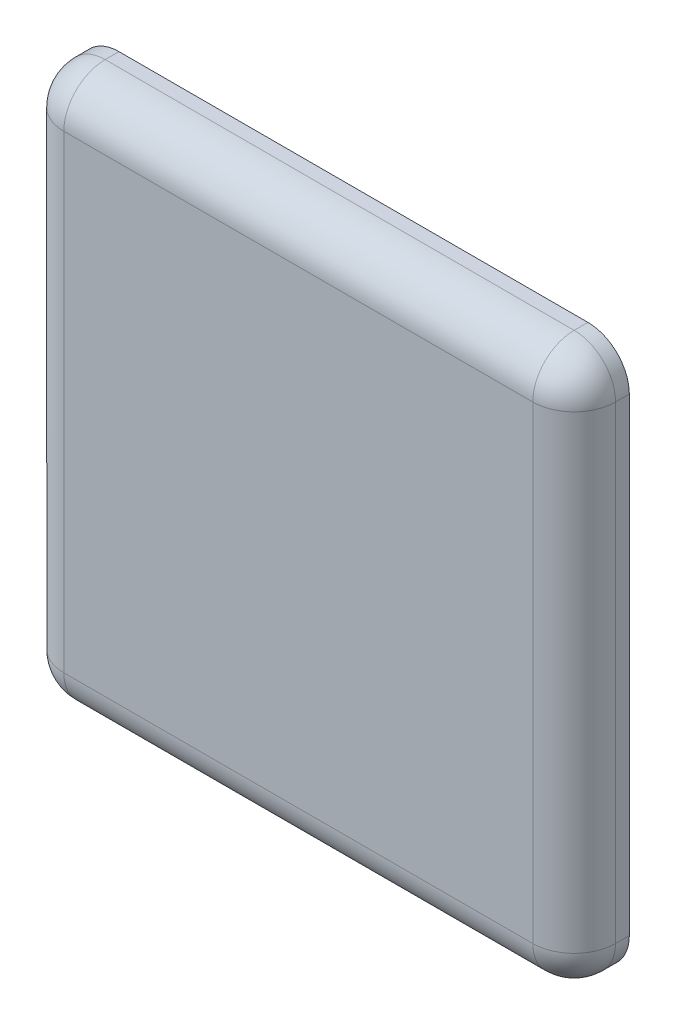
ISO-10303-21;
HEADER;
FILE_DESCRIPTION(('STEP AP214'),'2;1');
FILE_NAME('part.step','',(''),(''),'','','');
FILE_SCHEMA(('AUTOMOTIVE_DESIGN { 1 0 10303 214 1 1 1 1 }'));
ENDSEC;
DATA;
#1=APPLICATION_CONTEXT('core data for automotive mechanical design processes');
#2=APPLICATION_PROTOCOL_DEFINITION('international standard','automotive_design',2000,#1);
#3=PRODUCT_CONTEXT('',#1,'mechanical');
#4=PRODUCT('Part','Part','',(#3));
#5=PRODUCT_RELATED_PRODUCT_CATEGORY('part','',(#4));
#6=PRODUCT_DEFINITION_FORMATION('','',#4);
#7=PRODUCT_DEFINITION_CONTEXT('part definition',#1,'design');
#8=PRODUCT_DEFINITION('design','',#6,#7);
#9=PRODUCT_DEFINITION_SHAPE('','',#8);
#10=(LENGTH_UNIT() NAMED_UNIT(*) SI_UNIT(.MILLI.,.METRE.));
#11=(NAMED_UNIT(*) PLANE_ANGLE_UNIT() SI_UNIT($,.RADIAN.));
#12=(NAMED_UNIT(*) SI_UNIT($,.STERADIAN.) SOLID_ANGLE_UNIT());
#13=UNCERTAINTY_MEASURE_WITH_UNIT(LENGTH_MEASURE(1.E-05),#10,'distance_accuracy_value','');
#14=(GEOMETRIC_REPRESENTATION_CONTEXT(3) GLOBAL_UNCERTAINTY_ASSIGNED_CONTEXT((#13)) GLOBAL_UNIT_ASSIGNED_CONTEXT((#10,
#11,#12)) REPRESENTATION_CONTEXT('',''));
#15=CARTESIAN_POINT('',(0.,0.,0.));
#16=DIRECTION('',(0.,0.,1.));
#17=DIRECTION('',(1.,0.,0.));
#18=AXIS2_PLACEMENT_3D('',#15,#16,#17);
#19=CARTESIAN_POINT('',(0.,0.,3.));
#20=DIRECTION('',(0.,0.,1.));
#21=DIRECTION('',(1.,0.,0.));
#22=AXIS2_PLACEMENT_3D('',#19,#20,#21);
#23=PLANE('',#22);
#24=DIRECTION('',(-1.,0.,0.));
#25=VECTOR('',#24,1.);
#26=CARTESIAN_POINT('',(25.55241610428,12.75,3.));
#27=LINE('',#26,#25);
#28=CARTESIAN_POINT('',(-12.75,12.75,3.));
#29=VERTEX_POINT('',#28);
#30=CARTESIAN_POINT('',(12.75,12.75,3.));
#31=VERTEX_POINT('',#30);
#32=EDGE_CURVE('E104',#29,#31,#27,.F.);
#33=ORIENTED_EDGE('',*,*,#32,.F.);
#34=DIRECTION('',(0.,-1.,0.));
#35=VECTOR('',#34,1.);
#36=CARTESIAN_POINT('',(-12.75,25.55241610428,3.));
#37=LINE('',#36,#35);
#38=CARTESIAN_POINT('',(-12.75,-12.75,3.));
#39=VERTEX_POINT('',#38);
#40=EDGE_CURVE('E153',#39,#29,#37,.F.);
#41=ORIENTED_EDGE('',*,*,#40,.F.);
#42=DIRECTION('',(1.,0.,0.));
#43=VECTOR('',#42,1.);
#44=CARTESIAN_POINT('',(-25.55241610428,-12.75,3.));
#45=LINE('',#44,#43);
#46=CARTESIAN_POINT('',(12.75,-12.75,3.));
#47=VERTEX_POINT('',#46);
#48=EDGE_CURVE('E148',#47,#39,#45,.F.);
#49=ORIENTED_EDGE('',*,*,#48,.F.);
#50=DIRECTION('',(0.,1.,0.));
#51=VECTOR('',#50,1.);
#52=CARTESIAN_POINT('',(12.75,-25.55241610428,3.));
#53=LINE('',#52,#51);
#54=EDGE_CURVE('E163',#31,#47,#53,.F.);
#55=ORIENTED_EDGE('',*,*,#54,.F.);
#56=EDGE_LOOP('',(#33,#41,#49,#55));
#57=FACE_BOUND('',#56,.T.);
#58=ADVANCED_FACE('F17',(#57),#23,.T.);
#59=CARTESIAN_POINT('',(12.75,-25.55241610428,0.75));
#60=DIRECTION('',(0.,1.,0.));
#61=DIRECTION('',(0.,0.,1.));
#62=AXIS2_PLACEMENT_3D('',#59,#60,#61);
#63=CYLINDRICAL_SURFACE('',#62,2.25);
#64=DIRECTION('',(0.,1.,0.));
#65=VECTOR('',#64,1.);
#66=CARTESIAN_POINT('',(15.,-15.,0.75));
#67=LINE('',#66,#65);
#68=CARTESIAN_POINT('',(15.,12.7500000000249,0.750000000000007));
#69=VERTEX_POINT('',#68);
#70=CARTESIAN_POINT('',(15.,-12.75,0.75));
#71=VERTEX_POINT('',#70);
#72=EDGE_CURVE('E143',#69,#71,#67,.F.);
#73=ORIENTED_EDGE('',*,*,#72,.F.);
#74=CARTESIAN_POINT('',(12.75,12.75,0.750000000000014));
#75=DIRECTION('',(-2.21258256738488E-11,1.,2.21272083342952E-11));
#76=DIRECTION('',(0.,-2.21272083342952E-11,1.));
#77=AXIS2_PLACEMENT_3D('',#74,#75,#76);
#78=CIRCLE('',#77,2.25);
#79=CARTESIAN_POINT('',(14.3409902576697,12.75,2.34099025766974));
#80=VERTEX_POINT('',#79);
#81=EDGE_CURVE('E105',#80,#69,#78,.T.);
#82=ORIENTED_EDGE('',*,*,#81,.F.);
#83=CARTESIAN_POINT('',(12.75,12.75,0.75));
#84=DIRECTION('',(0.,1.,0.));
#85=DIRECTION('',(0.,0.,1.));
#86=AXIS2_PLACEMENT_3D('',#83,#84,#85);
#87=CIRCLE('',#86,2.25);
#88=EDGE_CURVE('E161',#80,#31,#87,.F.);
#89=ORIENTED_EDGE('',*,*,#88,.T.);
#90=ORIENTED_EDGE('',*,*,#54,.T.);
#91=CARTESIAN_POINT('',(12.75,-12.75,0.75));
#92=DIRECTION('',(0.,-1.,0.));
#93=DIRECTION('',(1.,0.,0.));
#94=AXIS2_PLACEMENT_3D('',#91,#92,#93);
#95=CIRCLE('',#94,2.25);
#96=EDGE_CURVE('E145',#71,#47,#95,.T.);
#97=ORIENTED_EDGE('',*,*,#96,.F.);
#98=EDGE_LOOP('',(#73,#82,#89,#90,#97));
#99=FACE_BOUND('',#98,.T.);
#100=ADVANCED_FACE('F209',(#99),#63,.T.);
#101=CARTESIAN_POINT('',(12.75,12.75,0.750000000000003));
#102=DIRECTION('',(0.707106781186549,0.,0.707106781186546));
#103=DIRECTION('',(-0.707106781186546,0.,0.707106781186549));
#104=AXIS2_PLACEMENT_3D('',#101,#102,#103);
#105=SPHERICAL_SURFACE('',#104,2.25);
#106=ORIENTED_EDGE('',*,*,#81,.T.);
#107=CARTESIAN_POINT('',(12.75,12.75,0.75));
#108=DIRECTION('',(0.,0.,-1.));
#109=DIRECTION('',(-1.,0.,0.));
#110=AXIS2_PLACEMENT_3D('',#107,#108,#109);
#111=CIRCLE('',#110,2.25);
#112=CARTESIAN_POINT('',(12.75,15.,0.749999999999997));
#113=VERTEX_POINT('',#112);
#114=EDGE_CURVE('E137',#113,#69,#111,.T.);
#115=ORIENTED_EDGE('',*,*,#114,.F.);
#116=CARTESIAN_POINT('',(12.75,12.75,0.75));
#117=DIRECTION('',(-1.,0.,0.));
#118=DIRECTION('',(0.,0.,1.));
#119=AXIS2_PLACEMENT_3D('',#116,#117,#118);
#120=CIRCLE('',#119,2.25);
#121=EDGE_CURVE('E119',#31,#113,#120,.T.);
#122=ORIENTED_EDGE('',*,*,#121,.F.);
#123=ORIENTED_EDGE('',*,*,#88,.F.);
#124=EDGE_LOOP('',(#106,#115,#122,#123));
#125=FACE_BOUND('',#124,.T.);
#126=ADVANCED_FACE('F206',(#125),#105,.T.);
#127=CARTESIAN_POINT('',(25.55241610428,12.75,0.75));
#128=DIRECTION('',(-1.,0.,0.));
#129=DIRECTION('',(0.,0.,1.));
#130=AXIS2_PLACEMENT_3D('',#127,#128,#129);
#131=CYLINDRICAL_SURFACE('',#130,2.25);
#132=ORIENTED_EDGE('',*,*,#121,.T.);
#133=DIRECTION('',(1.,0.,0.));
#134=VECTOR('',#133,1.);
#135=CARTESIAN_POINT('',(15.,15.,0.75));
#136=LINE('',#135,#134);
#137=CARTESIAN_POINT('',(-12.75,15.,0.75));
#138=VERTEX_POINT('',#137);
#139=EDGE_CURVE('E116',#138,#113,#136,.T.);
#140=ORIENTED_EDGE('',*,*,#139,.F.);
#141=CARTESIAN_POINT('',(-12.75,12.75,0.75));
#142=DIRECTION('',(-1.,0.,0.));
#143=DIRECTION('',(0.,0.,1.));
#144=AXIS2_PLACEMENT_3D('',#141,#142,#143);
#145=CIRCLE('',#144,2.25);
#146=EDGE_CURVE('E21',#138,#29,#145,.F.);
#147=ORIENTED_EDGE('',*,*,#146,.T.);
#148=ORIENTED_EDGE('',*,*,#32,.T.);
#149=EDGE_LOOP('',(#132,#140,#147,#148));
#150=FACE_BOUND('',#149,.T.);
#151=ADVANCED_FACE('F117',(#150),#131,.T.);
#152=CARTESIAN_POINT('',(-12.75,12.75,0.750000000000001));
#153=DIRECTION('',(-0.707106781186547,0.,0.707106781186548));
#154=DIRECTION('',(0.,-1.,0.));
#155=AXIS2_PLACEMENT_3D('',#152,#153,#154);
#156=SPHERICAL_SURFACE('',#155,2.25);
#157=CARTESIAN_POINT('',(-12.75,12.75,0.75));
#158=DIRECTION('',(0.,-1.,0.));
#159=DIRECTION('',(0.,0.,-1.));
#160=AXIS2_PLACEMENT_3D('',#157,#158,#159);
#161=CIRCLE('',#160,2.25);
#162=CARTESIAN_POINT('',(-15.,12.75,0.75));
#163=VERTEX_POINT('',#162);
#164=EDGE_CURVE('E99',#29,#163,#161,.T.);
#165=ORIENTED_EDGE('',*,*,#164,.F.);
#166=ORIENTED_EDGE('',*,*,#146,.F.);
#167=CARTESIAN_POINT('',(-12.75,12.75,0.75));
#168=DIRECTION('',(0.,0.,-1.));
#169=DIRECTION('',(-1.,0.,0.));
#170=AXIS2_PLACEMENT_3D('',#167,#168,#169);
#171=CIRCLE('',#170,2.25);
#172=EDGE_CURVE('E97',#163,#138,#171,.T.);
#173=ORIENTED_EDGE('',*,*,#172,.F.);
#174=EDGE_LOOP('',(#165,#166,#173));
#175=FACE_BOUND('',#174,.T.);
#176=ADVANCED_FACE('F96',(#175),#156,.T.);
#177=CARTESIAN_POINT('',(-12.75,25.55241610428,0.75));
#178=DIRECTION('',(0.,-1.,0.));
#179=DIRECTION('',(0.,0.,-1.));
#180=AXIS2_PLACEMENT_3D('',#177,#178,#179);
#181=CYLINDRICAL_SURFACE('',#180,2.25);
#182=ORIENTED_EDGE('',*,*,#164,.T.);
#183=DIRECTION('',(0.,1.,0.));
#184=VECTOR('',#183,1.);
#185=CARTESIAN_POINT('',(-15.,15.,0.75));
#186=LINE('',#185,#184);
#187=CARTESIAN_POINT('',(-15.,-12.75,0.749999999999999));
#188=VERTEX_POINT('',#187);
#189=EDGE_CURVE('E128',#188,#163,#186,.T.);
#190=ORIENTED_EDGE('',*,*,#189,.F.);
#191=CARTESIAN_POINT('',(-12.75,-12.75,0.75));
#192=DIRECTION('',(0.,-1.,0.));
#193=DIRECTION('',(0.,0.,-1.));
#194=AXIS2_PLACEMENT_3D('',#191,#192,#193);
#195=CIRCLE('',#194,2.25);
#196=EDGE_CURVE('E159',#188,#39,#195,.F.);
#197=ORIENTED_EDGE('',*,*,#196,.T.);
#198=ORIENTED_EDGE('',*,*,#40,.T.);
#199=EDGE_LOOP('',(#182,#190,#197,#198));
#200=FACE_BOUND('',#199,.T.);
#201=ADVANCED_FACE('F191',(#200),#181,.T.);
#202=CARTESIAN_POINT('',(-12.75,-12.75,0.750000000000001));
#203=DIRECTION('',(0.,-0.707106781186547,0.707106781186548));
#204=DIRECTION('',(1.,0.,0.));
#205=AXIS2_PLACEMENT_3D('',#202,#203,#204);
#206=SPHERICAL_SURFACE('',#205,2.25);
#207=CARTESIAN_POINT('',(-12.75,-12.75,0.75));
#208=DIRECTION('',(1.,0.,0.));
#209=DIRECTION('',(0.,0.,-1.));
#210=AXIS2_PLACEMENT_3D('',#207,#208,#209);
#211=CIRCLE('',#210,2.25);
#212=CARTESIAN_POINT('',(-12.75,-15.,0.75));
#213=VERTEX_POINT('',#212);
#214=EDGE_CURVE('E146',#39,#213,#211,.T.);
#215=ORIENTED_EDGE('',*,*,#214,.F.);
#216=ORIENTED_EDGE('',*,*,#196,.F.);
#217=CARTESIAN_POINT('',(-12.75,-12.75,0.75));
#218=DIRECTION('',(0.,0.,-1.));
#219=DIRECTION('',(-1.,0.,0.));
#220=AXIS2_PLACEMENT_3D('',#217,#218,#219);
#221=CIRCLE('',#220,2.25);
#222=EDGE_CURVE('E181',#213,#188,#221,.T.);
#223=ORIENTED_EDGE('',*,*,#222,.F.);
#224=EDGE_LOOP('',(#215,#216,#223));
#225=FACE_BOUND('',#224,.T.);
#226=ADVANCED_FACE('F261',(#225),#206,.T.);
#227=CARTESIAN_POINT('',(-25.55241610428,-12.75,0.75));
#228=DIRECTION('',(1.,0.,0.));
#229=DIRECTION('',(0.,0.,-1.));
#230=AXIS2_PLACEMENT_3D('',#227,#228,#229);
#231=CYLINDRICAL_SURFACE('',#230,2.25);
#232=ORIENTED_EDGE('',*,*,#214,.T.);
#233=DIRECTION('',(1.,0.,0.));
#234=VECTOR('',#233,1.);
#235=CARTESIAN_POINT('',(-15.,-15.,0.75));
#236=LINE('',#235,#234);
#237=CARTESIAN_POINT('',(12.75,-15.,0.75));
#238=VERTEX_POINT('',#237);
#239=EDGE_CURVE('E138',#238,#213,#236,.F.);
#240=ORIENTED_EDGE('',*,*,#239,.F.);
#241=CARTESIAN_POINT('',(12.75,-12.75,0.75));
#242=DIRECTION('',(1.,0.,0.));
#243=DIRECTION('',(0.,0.,-1.));
#244=AXIS2_PLACEMENT_3D('',#241,#242,#243);
#245=CIRCLE('',#244,2.25);
#246=EDGE_CURVE('E152',#238,#47,#245,.F.);
#247=ORIENTED_EDGE('',*,*,#246,.T.);
#248=ORIENTED_EDGE('',*,*,#48,.T.);
#249=EDGE_LOOP('',(#232,#240,#247,#248));
#250=FACE_BOUND('',#249,.T.);
#251=ADVANCED_FACE('F199',(#250),#231,.T.);
#252=CARTESIAN_POINT('',(12.75,-12.75,0.750000000000001));
#253=DIRECTION('',(0.707106781186547,0.,0.707106781186548));
#254=DIRECTION('',(0.,1.,0.));
#255=AXIS2_PLACEMENT_3D('',#252,#253,#254);
#256=SPHERICAL_SURFACE('',#255,2.25);
#257=ORIENTED_EDGE('',*,*,#96,.T.);
#258=ORIENTED_EDGE('',*,*,#246,.F.);
#259=CARTESIAN_POINT('',(12.75,-12.75,0.75));
#260=DIRECTION('',(0.,0.,-1.));
#261=DIRECTION('',(-1.,0.,0.));
#262=AXIS2_PLACEMENT_3D('',#259,#260,#261);
#263=CIRCLE('',#262,2.25);
#264=EDGE_CURVE('E178',#71,#238,#263,.T.);
#265=ORIENTED_EDGE('',*,*,#264,.F.);
#266=EDGE_LOOP('',(#257,#258,#265));
#267=FACE_BOUND('',#266,.T.);
#268=ADVANCED_FACE('F19',(#267),#256,.T.);
#269=CARTESIAN_POINT('',(15.,-15.,0.));
#270=DIRECTION('',(1.,0.,0.));
#271=DIRECTION('',(0.,0.,-1.));
#272=AXIS2_PLACEMENT_3D('',#269,#270,#271);
#273=PLANE('',#272);
#274=DIRECTION('',(0.,0.,-1.));
#275=VECTOR('',#274,1.);
#276=CARTESIAN_POINT('',(15.,-12.75,3.07302480451));
#277=LINE('',#276,#275);
#278=CARTESIAN_POINT('',(15.,-12.75,0.));
#279=VERTEX_POINT('',#278);
#280=EDGE_CURVE('E180',#279,#71,#277,.F.);
#281=ORIENTED_EDGE('',*,*,#280,.F.);
#282=DIRECTION('',(0.,1.,0.));
#283=VECTOR('',#282,1.);
#284=CARTESIAN_POINT('',(15.,0.,0.));
#285=LINE('',#284,#283);
#286=CARTESIAN_POINT('',(15.,12.75,0.));
#287=VERTEX_POINT('',#286);
#288=EDGE_CURVE('E177',#279,#287,#285,.T.);
#289=ORIENTED_EDGE('',*,*,#288,.T.);
#290=DIRECTION('',(0.,0.,-1.));
#291=VECTOR('',#290,1.);
#292=CARTESIAN_POINT('',(15.,12.75,3.07302480451));
#293=LINE('',#292,#291);
#294=EDGE_CURVE('E122',#69,#287,#293,.T.);
#295=ORIENTED_EDGE('',*,*,#294,.F.);
#296=ORIENTED_EDGE('',*,*,#72,.T.);
#297=EDGE_LOOP('',(#281,#289,#295,#296));
#298=FACE_BOUND('',#297,.T.);
#299=ADVANCED_FACE('F308',(#298),#273,.T.);
#300=CARTESIAN_POINT('',(12.75,12.75,3.07302480451));
#301=DIRECTION('',(0.,0.,-1.));
#302=DIRECTION('',(-1.,0.,0.));
#303=AXIS2_PLACEMENT_3D('',#300,#301,#302);
#304=CYLINDRICAL_SURFACE('',#303,2.25);
#305=ORIENTED_EDGE('',*,*,#114,.T.);
#306=ORIENTED_EDGE('',*,*,#294,.T.);
#307=CARTESIAN_POINT('',(12.75,12.75,0.));
#308=DIRECTION('',(0.,0.,-1.));
#309=DIRECTION('',(-1.,0.,0.));
#310=AXIS2_PLACEMENT_3D('',#307,#308,#309);
#311=CIRCLE('',#310,2.25);
#312=CARTESIAN_POINT('',(12.75,15.,0.));
#313=VERTEX_POINT('',#312);
#314=EDGE_CURVE('E174',#287,#313,#311,.F.);
#315=ORIENTED_EDGE('',*,*,#314,.T.);
#316=DIRECTION('',(0.,0.,1.));
#317=VECTOR('',#316,1.);
#318=CARTESIAN_POINT('',(12.75,15.,0.));
#319=LINE('',#318,#317);
#320=EDGE_CURVE('E113',#113,#313,#319,.F.);
#321=ORIENTED_EDGE('',*,*,#320,.F.);
#322=EDGE_LOOP('',(#305,#306,#315,#321));
#323=FACE_BOUND('',#322,.T.);
#324=ADVANCED_FACE('F301',(#323),#304,.T.);
#325=CARTESIAN_POINT('',(15.,15.,0.));
#326=DIRECTION('',(0.,1.,0.));
#327=DIRECTION('',(0.,0.,1.));
#328=AXIS2_PLACEMENT_3D('',#325,#326,#327);
#329=PLANE('',#328);
#330=ORIENTED_EDGE('',*,*,#320,.T.);
#331=DIRECTION('',(1.,0.,0.));
#332=VECTOR('',#331,1.);
#333=CARTESIAN_POINT('',(0.,15.,0.));
#334=LINE('',#333,#332);
#335=CARTESIAN_POINT('',(-12.75,15.,0.));
#336=VERTEX_POINT('',#335);
#337=EDGE_CURVE('E127',#313,#336,#334,.F.);
#338=ORIENTED_EDGE('',*,*,#337,.T.);
#339=DIRECTION('',(0.,0.,-1.));
#340=VECTOR('',#339,1.);
#341=CARTESIAN_POINT('',(-12.75,15.,3.07302480451));
#342=LINE('',#341,#340);
#343=EDGE_CURVE('E110',#138,#336,#342,.T.);
#344=ORIENTED_EDGE('',*,*,#343,.F.);
#345=ORIENTED_EDGE('',*,*,#139,.T.);
#346=EDGE_LOOP('',(#330,#338,#344,#345));
#347=FACE_BOUND('',#346,.T.);
#348=ADVANCED_FACE('F125',(#347),#329,.T.);
#349=CARTESIAN_POINT('',(-12.75,12.75,3.07302480451));
#350=DIRECTION('',(0.,0.,-1.));
#351=DIRECTION('',(-1.,0.,0.));
#352=AXIS2_PLACEMENT_3D('',#349,#350,#351);
#353=CYLINDRICAL_SURFACE('',#352,2.25);
#354=ORIENTED_EDGE('',*,*,#172,.T.);
#355=ORIENTED_EDGE('',*,*,#343,.T.);
#356=CARTESIAN_POINT('',(-12.75,12.75,0.));
#357=DIRECTION('',(0.,0.,-1.));
#358=DIRECTION('',(-1.,0.,0.));
#359=AXIS2_PLACEMENT_3D('',#356,#357,#358);
#360=CIRCLE('',#359,2.25);
#361=CARTESIAN_POINT('',(-15.,12.75,0.));
#362=VERTEX_POINT('',#361);
#363=EDGE_CURVE('E172',#336,#362,#360,.F.);
#364=ORIENTED_EDGE('',*,*,#363,.T.);
#365=DIRECTION('',(0.,0.,1.));
#366=VECTOR('',#365,1.);
#367=CARTESIAN_POINT('',(-15.,12.75,0.));
#368=LINE('',#367,#366);
#369=EDGE_CURVE('E112',#163,#362,#368,.F.);
#370=ORIENTED_EDGE('',*,*,#369,.F.);
#371=EDGE_LOOP('',(#354,#355,#364,#370));
#372=FACE_BOUND('',#371,.T.);
#373=ADVANCED_FACE('F107',(#372),#353,.T.);
#374=CARTESIAN_POINT('',(-15.,15.,0.));
#375=DIRECTION('',(-1.,0.,0.));
#376=DIRECTION('',(0.,0.,1.));
#377=AXIS2_PLACEMENT_3D('',#374,#375,#376);
#378=PLANE('',#377);
#379=ORIENTED_EDGE('',*,*,#369,.T.);
#380=DIRECTION('',(0.,1.,0.));
#381=VECTOR('',#380,1.);
#382=CARTESIAN_POINT('',(-15.,0.,0.));
#383=LINE('',#382,#381);
#384=CARTESIAN_POINT('',(-15.,-12.75,0.));
#385=VERTEX_POINT('',#384);
#386=EDGE_CURVE('E171',#362,#385,#383,.F.);
#387=ORIENTED_EDGE('',*,*,#386,.T.);
#388=DIRECTION('',(0.,0.,-1.));
#389=VECTOR('',#388,1.);
#390=CARTESIAN_POINT('',(-15.,-12.75,3.07302480451));
#391=LINE('',#390,#389);
#392=EDGE_CURVE('E142',#188,#385,#391,.T.);
#393=ORIENTED_EDGE('',*,*,#392,.F.);
#394=ORIENTED_EDGE('',*,*,#189,.T.);
#395=EDGE_LOOP('',(#379,#387,#393,#394));
#396=FACE_BOUND('',#395,.T.);
#397=ADVANCED_FACE('F238',(#396),#378,.T.);
#398=CARTESIAN_POINT('',(-12.75,-12.75,3.07302480451));
#399=DIRECTION('',(0.,0.,-1.));
#400=DIRECTION('',(-1.,0.,0.));
#401=AXIS2_PLACEMENT_3D('',#398,#399,#400);
#402=CYLINDRICAL_SURFACE('',#401,2.25);
#403=ORIENTED_EDGE('',*,*,#222,.T.);
#404=ORIENTED_EDGE('',*,*,#392,.T.);
#405=CARTESIAN_POINT('',(-12.75,-12.75,0.));
#406=DIRECTION('',(0.,0.,-1.));
#407=DIRECTION('',(-1.,0.,0.));
#408=AXIS2_PLACEMENT_3D('',#405,#406,#407);
#409=CIRCLE('',#408,2.25);
#410=CARTESIAN_POINT('',(-12.75,-15.,0.));
#411=VERTEX_POINT('',#410);
#412=EDGE_CURVE('E168',#385,#411,#409,.F.);
#413=ORIENTED_EDGE('',*,*,#412,.T.);
#414=DIRECTION('',(0.,0.,-1.));
#415=VECTOR('',#414,1.);
#416=CARTESIAN_POINT('',(-12.75,-15.,0.));
#417=LINE('',#416,#415);
#418=EDGE_CURVE('E141',#213,#411,#417,.T.);
#419=ORIENTED_EDGE('',*,*,#418,.F.);
#420=EDGE_LOOP('',(#403,#404,#413,#419));
#421=FACE_BOUND('',#420,.T.);
#422=ADVANCED_FACE('F231',(#421),#402,.T.);
#423=CARTESIAN_POINT('',(-15.,-15.,0.));
#424=DIRECTION('',(0.,-1.,0.));
#425=DIRECTION('',(0.,0.,-1.));
#426=AXIS2_PLACEMENT_3D('',#423,#424,#425);
#427=PLANE('',#426);
#428=ORIENTED_EDGE('',*,*,#418,.T.);
#429=DIRECTION('',(1.,0.,0.));
#430=VECTOR('',#429,1.);
#431=CARTESIAN_POINT('',(0.,-15.,0.));
#432=LINE('',#431,#430);
#433=CARTESIAN_POINT('',(12.75,-15.,0.));
#434=VERTEX_POINT('',#433);
#435=EDGE_CURVE('E27',#411,#434,#432,.T.);
#436=ORIENTED_EDGE('',*,*,#435,.T.);
#437=DIRECTION('',(0.,0.,-1.));
#438=VECTOR('',#437,1.);
#439=CARTESIAN_POINT('',(12.75,-15.,3.07302480451));
#440=LINE('',#439,#438);
#441=EDGE_CURVE('E35',#238,#434,#440,.T.);
#442=ORIENTED_EDGE('',*,*,#441,.F.);
#443=ORIENTED_EDGE('',*,*,#239,.T.);
#444=EDGE_LOOP('',(#428,#436,#442,#443));
#445=FACE_BOUND('',#444,.T.);
#446=ADVANCED_FACE('F246',(#445),#427,.T.);
#447=CARTESIAN_POINT('',(12.75,-12.75,3.07302480451));
#448=DIRECTION('',(0.,0.,-1.));
#449=DIRECTION('',(-1.,0.,0.));
#450=AXIS2_PLACEMENT_3D('',#447,#448,#449);
#451=CYLINDRICAL_SURFACE('',#450,2.25);
#452=ORIENTED_EDGE('',*,*,#264,.T.);
#453=ORIENTED_EDGE('',*,*,#441,.T.);
#454=CARTESIAN_POINT('',(12.75,-12.75,0.));
#455=DIRECTION('',(0.,0.,-1.));
#456=DIRECTION('',(-1.,0.,0.));
#457=AXIS2_PLACEMENT_3D('',#454,#455,#456);
#458=CIRCLE('',#457,2.25);
#459=EDGE_CURVE('E11',#434,#279,#458,.F.);
#460=ORIENTED_EDGE('',*,*,#459,.T.);
#461=ORIENTED_EDGE('',*,*,#280,.T.);
#462=EDGE_LOOP('',(#452,#453,#460,#461));
#463=FACE_BOUND('',#462,.T.);
#464=ADVANCED_FACE('F250',(#463),#451,.T.);
#465=CARTESIAN_POINT('',(0.,0.,0.));
#466=DIRECTION('',(0.,0.,1.));
#467=DIRECTION('',(1.,0.,0.));
#468=AXIS2_PLACEMENT_3D('',#465,#466,#467);
#469=PLANE('',#468);
#470=ORIENTED_EDGE('',*,*,#435,.F.);
#471=ORIENTED_EDGE('',*,*,#412,.F.);
#472=ORIENTED_EDGE('',*,*,#386,.F.);
#473=ORIENTED_EDGE('',*,*,#363,.F.);
#474=ORIENTED_EDGE('',*,*,#337,.F.);
#475=ORIENTED_EDGE('',*,*,#314,.F.);
#476=ORIENTED_EDGE('',*,*,#288,.F.);
#477=ORIENTED_EDGE('',*,*,#459,.F.);
#478=EDGE_LOOP('',(#470,#471,#472,#473,#474,#475,#476,#477));
#479=FACE_BOUND('',#478,.T.);
#480=ADVANCED_FACE('F237',(#479),#469,.F.);
#481=CLOSED_SHELL('',(#58,#100,#126,#151,#176,#201,#226,#251,#268,#299,#324,#348,#373,#397,#422,
#446,#464,#480));
#482=MANIFOLD_SOLID_BREP('B1',#481);
#483=ADVANCED_BREP_SHAPE_REPRESENTATION('',(#18,#482),#14);
#484=SHAPE_DEFINITION_REPRESENTATION(#9,#483);
ENDSEC;
END-ISO-10303-21;
